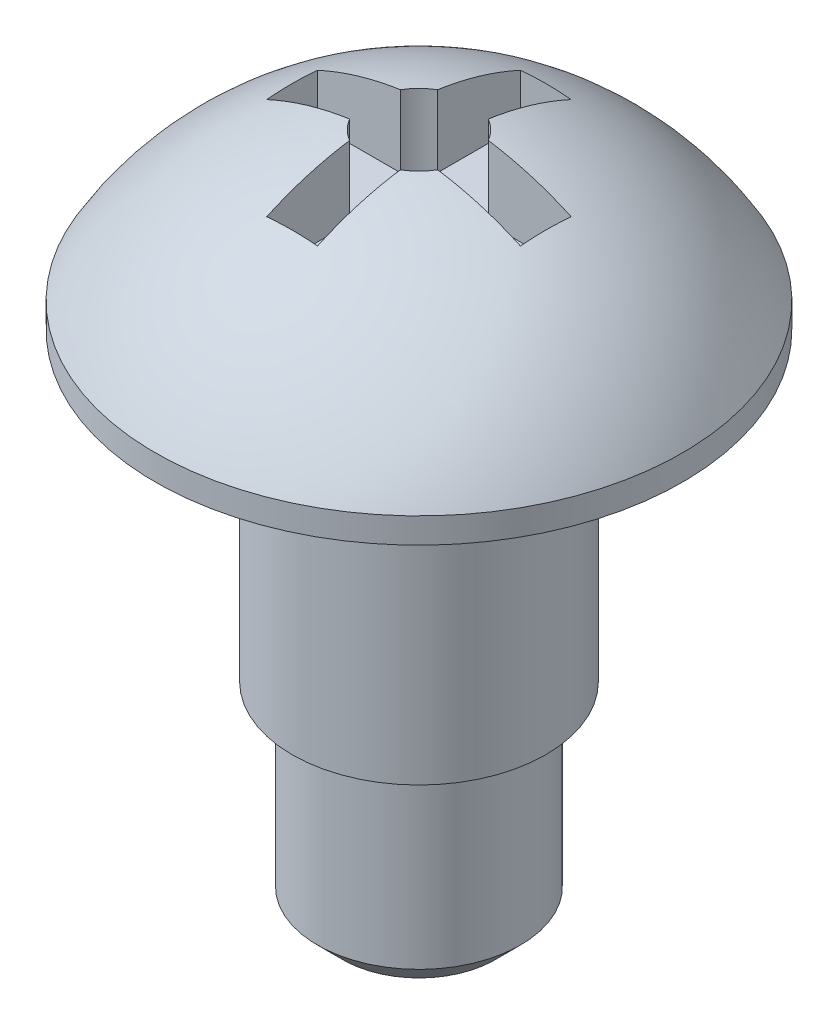
ISO-10303-21;
HEADER;
FILE_DESCRIPTION(('STEP AP214'),'2;1');
FILE_NAME('part.step','',(''),(''),'','','');
FILE_SCHEMA(('AUTOMOTIVE_DESIGN { 1 0 10303 214 1 1 1 1 }'));
ENDSEC;
DATA;
#1=APPLICATION_CONTEXT('core data for automotive mechanical design processes');
#2=APPLICATION_PROTOCOL_DEFINITION('international standard','automotive_design',2000,#1);
#3=PRODUCT_CONTEXT('',#1,'mechanical');
#4=PRODUCT('Part','Part','',(#3));
#5=PRODUCT_RELATED_PRODUCT_CATEGORY('part','',(#4));
#6=PRODUCT_DEFINITION_FORMATION('','',#4);
#7=PRODUCT_DEFINITION_CONTEXT('part definition',#1,'design');
#8=PRODUCT_DEFINITION('design','',#6,#7);
#9=PRODUCT_DEFINITION_SHAPE('','',#8);
#10=(LENGTH_UNIT() NAMED_UNIT(*) SI_UNIT(.MILLI.,.METRE.));
#11=(NAMED_UNIT(*) PLANE_ANGLE_UNIT() SI_UNIT($,.RADIAN.));
#12=(NAMED_UNIT(*) SI_UNIT($,.STERADIAN.) SOLID_ANGLE_UNIT());
#13=UNCERTAINTY_MEASURE_WITH_UNIT(LENGTH_MEASURE(1.E-05),#10,'distance_accuracy_value','');
#14=(GEOMETRIC_REPRESENTATION_CONTEXT(3) GLOBAL_UNCERTAINTY_ASSIGNED_CONTEXT((#13)) GLOBAL_UNIT_ASSIGNED_CONTEXT((#10,
#11,#12)) REPRESENTATION_CONTEXT('',''));
#15=CARTESIAN_POINT('',(0.,0.,0.));
#16=DIRECTION('',(0.,0.,1.));
#17=DIRECTION('',(1.,0.,0.));
#18=AXIS2_PLACEMENT_3D('',#15,#16,#17);
#19=CARTESIAN_POINT('',(0.,0.,0.));
#20=DIRECTION('',(0.,-1.,0.));
#21=DIRECTION('',(1.,0.,0.));
#22=AXIS2_PLACEMENT_3D('',#19,#20,#21);
#23=SPHERICAL_SURFACE('',#22,6.);
#24=CARTESIAN_POINT('',(0.,3.,0.));
#25=DIRECTION('',(0.,-1.,0.));
#26=DIRECTION('',(0.,0.,-1.));
#27=AXIS2_PLACEMENT_3D('',#24,#25,#26);
#28=CIRCLE('',#27,5.19615242270663);
#29=CARTESIAN_POINT('',(0.,3.,-5.19615242270663));
#30=VERTEX_POINT('',#29);
#31=EDGE_CURVE('E176',#30,#30,#28,.T.);
#32=ORIENTED_EDGE('',*,*,#31,.F.);
#33=EDGE_LOOP('',(#32));
#34=FACE_BOUND('',#33,.T.);
#35=CARTESIAN_POINT('',(-0.5,0.,0.));
#36=DIRECTION('',(1.,0.,0.));
#37=DIRECTION('',(0.,0.,-1.));
#38=AXIS2_PLACEMENT_3D('',#35,#36,#37);
#39=CIRCLE('',#38,5.9791303715507);
#40=CARTESIAN_POINT('',(-0.5,5.91607978309962,-0.866025403784439));
#41=VERTEX_POINT('',#40);
#42=CARTESIAN_POINT('',(-0.5,5.43139024560011,-2.5));
#43=VERTEX_POINT('',#42);
#44=EDGE_CURVE('E185',#41,#43,#39,.F.);
#45=ORIENTED_EDGE('',*,*,#44,.T.);
#46=CARTESIAN_POINT('',(0.,0.,-2.5));
#47=DIRECTION('',(0.,0.,1.));
#48=DIRECTION('',(1.,0.,0.));
#49=AXIS2_PLACEMENT_3D('',#46,#47,#48);
#50=CIRCLE('',#49,5.45435605731786);
#51=CARTESIAN_POINT('',(0.5,5.43139024560011,-2.5));
#52=VERTEX_POINT('',#51);
#53=EDGE_CURVE('E11',#43,#52,#50,.F.);
#54=ORIENTED_EDGE('',*,*,#53,.T.);
#55=CARTESIAN_POINT('',(0.5,0.,0.));
#56=DIRECTION('',(-1.,0.,0.));
#57=DIRECTION('',(0.,0.,1.));
#58=AXIS2_PLACEMENT_3D('',#55,#56,#57);
#59=CIRCLE('',#58,5.9791303715507);
#60=CARTESIAN_POINT('',(0.5,5.91607978309962,-0.866025403784439));
#61=VERTEX_POINT('',#60);
#62=EDGE_CURVE('E38',#52,#61,#59,.F.);
#63=ORIENTED_EDGE('',*,*,#62,.T.);
#64=CARTESIAN_POINT('',(0.,5.91607978309962,0.));
#65=DIRECTION('',(0.,-1.,0.));
#66=DIRECTION('',(0.,0.,-1.));
#67=AXIS2_PLACEMENT_3D('',#64,#65,#66);
#68=CIRCLE('',#67,1.);
#69=CARTESIAN_POINT('',(0.866025403784434,5.91607978309962,-0.500000000000009));
#70=VERTEX_POINT('',#69);
#71=EDGE_CURVE('E224',#61,#70,#68,.T.);
#72=ORIENTED_EDGE('',*,*,#71,.T.);
#73=CARTESIAN_POINT('',(0.,0.,-0.500000000000014));
#74=DIRECTION('',(0.,0.,1.));
#75=DIRECTION('',(1.,0.,0.));
#76=AXIS2_PLACEMENT_3D('',#73,#74,#75);
#77=CIRCLE('',#76,5.9791303715507);
#78=CARTESIAN_POINT('',(2.5,5.43139024560011,-0.499999999999999));
#79=VERTEX_POINT('',#78);
#80=EDGE_CURVE('E221',#70,#79,#77,.F.);
#81=ORIENTED_EDGE('',*,*,#80,.T.);
#82=CARTESIAN_POINT('',(2.5,0.,0.));
#83=DIRECTION('',(-1.,0.,0.));
#84=DIRECTION('',(0.,0.,1.));
#85=AXIS2_PLACEMENT_3D('',#82,#83,#84);
#86=CIRCLE('',#85,5.45435605731786);
#87=CARTESIAN_POINT('',(2.5,5.43139024560011,0.5));
#88=VERTEX_POINT('',#87);
#89=EDGE_CURVE('E218',#79,#88,#86,.F.);
#90=ORIENTED_EDGE('',*,*,#89,.T.);
#91=CARTESIAN_POINT('',(0.,0.,0.499999999999986));
#92=DIRECTION('',(0.,0.,-1.));
#93=DIRECTION('',(-1.,0.,0.));
#94=AXIS2_PLACEMENT_3D('',#91,#92,#93);
#95=CIRCLE('',#94,5.9791303715507);
#96=CARTESIAN_POINT('',(0.866025403784444,5.91607978309962,0.499999999999991));
#97=VERTEX_POINT('',#96);
#98=EDGE_CURVE('E215',#88,#97,#95,.F.);
#99=ORIENTED_EDGE('',*,*,#98,.T.);
#100=CARTESIAN_POINT('',(0.,5.91607978309962,0.));
#101=DIRECTION('',(0.,-1.,0.));
#102=DIRECTION('',(0.,0.,-1.));
#103=AXIS2_PLACEMENT_3D('',#100,#101,#102);
#104=CIRCLE('',#103,1.);
#105=CARTESIAN_POINT('',(0.500000000000006,5.91607978309962,0.866025403784435));
#106=VERTEX_POINT('',#105);
#107=EDGE_CURVE('E212',#97,#106,#104,.T.);
#108=ORIENTED_EDGE('',*,*,#107,.T.);
#109=CARTESIAN_POINT('',(0.500000000000009,0.,0.));
#110=DIRECTION('',(-1.,0.,0.));
#111=DIRECTION('',(0.,0.,1.));
#112=AXIS2_PLACEMENT_3D('',#109,#110,#111);
#113=CIRCLE('',#112,5.9791303715507);
#114=CARTESIAN_POINT('',(0.499999999999999,5.43139024560011,2.5));
#115=VERTEX_POINT('',#114);
#116=EDGE_CURVE('E209',#106,#115,#113,.F.);
#117=ORIENTED_EDGE('',*,*,#116,.T.);
#118=CARTESIAN_POINT('',(0.,0.,2.5));
#119=DIRECTION('',(0.,0.,-1.));
#120=DIRECTION('',(-1.,0.,0.));
#121=AXIS2_PLACEMENT_3D('',#118,#119,#120);
#122=CIRCLE('',#121,5.45435605731786);
#123=CARTESIAN_POINT('',(-0.5,5.43139024560011,2.5));
#124=VERTEX_POINT('',#123);
#125=EDGE_CURVE('E206',#115,#124,#122,.F.);
#126=ORIENTED_EDGE('',*,*,#125,.T.);
#127=CARTESIAN_POINT('',(-0.49999999999999,0.,0.));
#128=DIRECTION('',(1.,0.,0.));
#129=DIRECTION('',(0.,0.,-1.));
#130=AXIS2_PLACEMENT_3D('',#127,#128,#129);
#131=CIRCLE('',#130,5.9791303715507);
#132=CARTESIAN_POINT('',(-0.499999999999994,5.91607978309962,0.866025403784442));
#133=VERTEX_POINT('',#132);
#134=EDGE_CURVE('E203',#124,#133,#131,.F.);
#135=ORIENTED_EDGE('',*,*,#134,.T.);
#136=CARTESIAN_POINT('',(0.,5.91607978309962,0.));
#137=DIRECTION('',(0.,-1.,0.));
#138=DIRECTION('',(0.,0.,-1.));
#139=AXIS2_PLACEMENT_3D('',#136,#137,#138);
#140=CIRCLE('',#139,1.);
#141=CARTESIAN_POINT('',(-0.866025403784437,5.91607978309962,0.500000000000003));
#142=VERTEX_POINT('',#141);
#143=EDGE_CURVE('E200',#133,#142,#140,.T.);
#144=ORIENTED_EDGE('',*,*,#143,.T.);
#145=CARTESIAN_POINT('',(0.,0.,0.500000000000004));
#146=DIRECTION('',(0.,0.,-1.));
#147=DIRECTION('',(-1.,0.,0.));
#148=AXIS2_PLACEMENT_3D('',#145,#146,#147);
#149=CIRCLE('',#148,5.9791303715507);
#150=CARTESIAN_POINT('',(-2.5,5.43139024560011,0.499999999999999));
#151=VERTEX_POINT('',#150);
#152=EDGE_CURVE('E197',#142,#151,#149,.F.);
#153=ORIENTED_EDGE('',*,*,#152,.T.);
#154=CARTESIAN_POINT('',(-2.5,0.,0.));
#155=DIRECTION('',(1.,0.,0.));
#156=DIRECTION('',(0.,0.,-1.));
#157=AXIS2_PLACEMENT_3D('',#154,#155,#156);
#158=CIRCLE('',#157,5.45435605731786);
#159=CARTESIAN_POINT('',(-2.5,5.43139024560011,-0.5));
#160=VERTEX_POINT('',#159);
#161=EDGE_CURVE('E194',#151,#160,#158,.F.);
#162=ORIENTED_EDGE('',*,*,#161,.T.);
#163=CARTESIAN_POINT('',(0.,0.,-0.499999999999995));
#164=DIRECTION('',(0.,0.,1.));
#165=DIRECTION('',(1.,0.,0.));
#166=AXIS2_PLACEMENT_3D('',#163,#164,#165);
#167=CIRCLE('',#166,5.9791303715507);
#168=CARTESIAN_POINT('',(-0.86602540378444,5.91607978309962,-0.499999999999997));
#169=VERTEX_POINT('',#168);
#170=EDGE_CURVE('E191',#160,#169,#167,.F.);
#171=ORIENTED_EDGE('',*,*,#170,.T.);
#172=CARTESIAN_POINT('',(0.,5.91607978309962,0.));
#173=DIRECTION('',(0.,-1.,0.));
#174=DIRECTION('',(0.,0.,-1.));
#175=AXIS2_PLACEMENT_3D('',#172,#173,#174);
#176=CIRCLE('',#175,1.);
#177=EDGE_CURVE('E188',#169,#41,#176,.T.);
#178=ORIENTED_EDGE('',*,*,#177,.T.);
#179=EDGE_LOOP('',(#45,#54,#63,#72,#81,#90,#99,#108,#117,#126,#135,#144,#153,#162,#171,#178));
#180=FACE_BOUND('',#179,.T.);
#181=ADVANCED_FACE('F31',(#34,#180),#23,.T.);
#182=CARTESIAN_POINT('',(0.,-3.5,0.));
#183=DIRECTION('',(0.,-1.,0.));
#184=DIRECTION('',(0.,0.,-1.));
#185=AXIS2_PLACEMENT_3D('',#182,#183,#184);
#186=PLANE('',#185);
#187=CARTESIAN_POINT('',(0.,-3.5,0.));
#188=DIRECTION('',(0.,-1.,0.));
#189=DIRECTION('',(0.,0.,-1.));
#190=AXIS2_PLACEMENT_3D('',#187,#188,#189);
#191=CIRCLE('',#190,2.5);
#192=CARTESIAN_POINT('',(0.,-3.5,-2.5));
#193=VERTEX_POINT('',#192);
#194=EDGE_CURVE('E170',#193,#193,#191,.T.);
#195=ORIENTED_EDGE('',*,*,#194,.T.);
#196=EDGE_LOOP('',(#195));
#197=FACE_BOUND('',#196,.T.);
#198=CARTESIAN_POINT('',(0.,-3.5,0.));
#199=DIRECTION('',(0.,-1.,0.));
#200=DIRECTION('',(0.,0.,-1.));
#201=AXIS2_PLACEMENT_3D('',#198,#199,#200);
#202=CIRCLE('',#201,2.);
#203=CARTESIAN_POINT('',(0.,-3.5,-2.));
#204=VERTEX_POINT('',#203);
#205=EDGE_CURVE('E158',#204,#204,#202,.T.);
#206=ORIENTED_EDGE('',*,*,#205,.F.);
#207=EDGE_LOOP('',(#206));
#208=FACE_BOUND('',#207,.T.);
#209=ADVANCED_FACE('F352',(#197,#208),#186,.T.);
#210=CARTESIAN_POINT('',(0.,2.5,0.));
#211=DIRECTION('',(0.,-1.,0.));
#212=DIRECTION('',(0.,0.,-1.));
#213=AXIS2_PLACEMENT_3D('',#210,#211,#212);
#214=PLANE('',#213);
#215=CARTESIAN_POINT('',(0.,2.5,0.));
#216=DIRECTION('',(0.,-1.,0.));
#217=DIRECTION('',(0.,0.,-1.));
#218=AXIS2_PLACEMENT_3D('',#215,#216,#217);
#219=CIRCLE('',#218,5.19615242270663);
#220=CARTESIAN_POINT('',(0.,2.5,-5.19615242270663));
#221=VERTEX_POINT('',#220);
#222=EDGE_CURVE('E173',#221,#221,#219,.T.);
#223=ORIENTED_EDGE('',*,*,#222,.T.);
#224=EDGE_LOOP('',(#223));
#225=FACE_BOUND('',#224,.T.);
#226=CARTESIAN_POINT('',(0.,2.5,0.));
#227=DIRECTION('',(0.,-1.,0.));
#228=DIRECTION('',(0.,0.,-1.));
#229=AXIS2_PLACEMENT_3D('',#226,#227,#228);
#230=CIRCLE('',#229,2.5);
#231=CARTESIAN_POINT('',(0.,2.5,-2.5));
#232=VERTEX_POINT('',#231);
#233=EDGE_CURVE('E162',#232,#232,#230,.T.);
#234=ORIENTED_EDGE('',*,*,#233,.F.);
#235=EDGE_LOOP('',(#234));
#236=FACE_BOUND('',#235,.T.);
#237=ADVANCED_FACE('F357',(#225,#236),#214,.T.);
#238=CARTESIAN_POINT('',(0.,2.5,0.));
#239=DIRECTION('',(0.,1.,0.));
#240=DIRECTION('',(0.,0.,1.));
#241=AXIS2_PLACEMENT_3D('',#238,#239,#240);
#242=CYLINDRICAL_SURFACE('',#241,5.19615242270663);
#243=ORIENTED_EDGE('',*,*,#222,.F.);
#244=EDGE_LOOP('',(#243));
#245=FACE_BOUND('',#244,.T.);
#246=ORIENTED_EDGE('',*,*,#31,.T.);
#247=EDGE_LOOP('',(#246));
#248=FACE_BOUND('',#247,.T.);
#249=ADVANCED_FACE('F362',(#245,#248),#242,.T.);
#250=CARTESIAN_POINT('',(0.,-3.5,0.));
#251=DIRECTION('',(0.,1.,0.));
#252=DIRECTION('',(0.,0.,1.));
#253=AXIS2_PLACEMENT_3D('',#250,#251,#252);
#254=CYLINDRICAL_SURFACE('',#253,2.5);
#255=ORIENTED_EDGE('',*,*,#194,.F.);
#256=EDGE_LOOP('',(#255));
#257=FACE_BOUND('',#256,.T.);
#258=ORIENTED_EDGE('',*,*,#233,.T.);
#259=EDGE_LOOP('',(#258));
#260=FACE_BOUND('',#259,.T.);
#261=ADVANCED_FACE('F364',(#257,#260),#254,.T.);
#262=CARTESIAN_POINT('',(0.,-7.5,0.));
#263=DIRECTION('',(0.,1.,0.));
#264=DIRECTION('',(0.,0.,1.));
#265=AXIS2_PLACEMENT_3D('',#262,#263,#264);
#266=CYLINDRICAL_SURFACE('',#265,2.);
#267=CARTESIAN_POINT('',(0.,-7.,0.));
#268=DIRECTION('',(0.,-1.,0.));
#269=DIRECTION('',(0.,0.,-1.));
#270=AXIS2_PLACEMENT_3D('',#267,#268,#269);
#271=CIRCLE('',#270,2.);
#272=CARTESIAN_POINT('',(0.,-7.,-2.));
#273=VERTEX_POINT('',#272);
#274=EDGE_CURVE('E182',#273,#273,#271,.F.);
#275=ORIENTED_EDGE('',*,*,#274,.T.);
#276=EDGE_LOOP('',(#275));
#277=FACE_BOUND('',#276,.T.);
#278=ORIENTED_EDGE('',*,*,#205,.T.);
#279=EDGE_LOOP('',(#278));
#280=FACE_BOUND('',#279,.T.);
#281=ADVANCED_FACE('F370',(#277,#280),#266,.T.);
#282=CARTESIAN_POINT('',(0.,-7.5,0.));
#283=DIRECTION('',(0.,-1.,0.));
#284=DIRECTION('',(0.,0.,-1.));
#285=AXIS2_PLACEMENT_3D('',#282,#283,#284);
#286=PLANE('',#285);
#287=CARTESIAN_POINT('',(0.,-7.5,0.));
#288=DIRECTION('',(0.,-1.,0.));
#289=DIRECTION('',(0.,0.,-1.));
#290=AXIS2_PLACEMENT_3D('',#287,#288,#289);
#291=CIRCLE('',#290,1.49999999999999);
#292=CARTESIAN_POINT('',(0.,-7.5,-1.49999999999999));
#293=VERTEX_POINT('',#292);
#294=EDGE_CURVE('E179',#293,#293,#291,.T.);
#295=ORIENTED_EDGE('',*,*,#294,.T.);
#296=EDGE_LOOP('',(#295));
#297=FACE_BOUND('',#296,.T.);
#298=ADVANCED_FACE('F379',(#297),#286,.T.);
#299=CARTESIAN_POINT('',(0.,-7.5,0.));
#300=DIRECTION('',(0.,1.,0.));
#301=DIRECTION('',(0.,0.,1.));
#302=AXIS2_PLACEMENT_3D('',#299,#300,#301);
#303=CONICAL_SURFACE('',#302,1.49999999999999,0.785398163397453);
#304=ORIENTED_EDGE('',*,*,#274,.F.);
#305=EDGE_LOOP('',(#304));
#306=FACE_BOUND('',#305,.T.);
#307=ORIENTED_EDGE('',*,*,#294,.F.);
#308=EDGE_LOOP('',(#307));
#309=FACE_BOUND('',#308,.T.);
#310=ADVANCED_FACE('F383',(#306,#309),#303,.T.);
#311=CARTESIAN_POINT('',(0.5,4.5,-2.5));
#312=DIRECTION('',(0.,0.,1.));
#313=DIRECTION('',(1.,0.,0.));
#314=AXIS2_PLACEMENT_3D('',#311,#312,#313);
#315=PLANE('',#314);
#316=DIRECTION('',(0.,1.,0.));
#317=VECTOR('',#316,1.);
#318=CARTESIAN_POINT('',(-0.5,4.5,-2.5));
#319=LINE('',#318,#317);
#320=CARTESIAN_POINT('',(-0.5,4.5,-2.5));
#321=VERTEX_POINT('',#320);
#322=EDGE_CURVE('E45',#321,#43,#319,.T.);
#323=ORIENTED_EDGE('',*,*,#322,.F.);
#324=DIRECTION('',(1.,0.,0.));
#325=VECTOR('',#324,1.);
#326=CARTESIAN_POINT('',(0.5,4.5,-2.5));
#327=LINE('',#326,#325);
#328=CARTESIAN_POINT('',(0.5,4.5,-2.5));
#329=VERTEX_POINT('',#328);
#330=EDGE_CURVE('E148',#321,#329,#327,.T.);
#331=ORIENTED_EDGE('',*,*,#330,.T.);
#332=DIRECTION('',(0.,1.,0.));
#333=VECTOR('',#332,1.);
#334=CARTESIAN_POINT('',(0.5,4.5,-2.5));
#335=LINE('',#334,#333);
#336=EDGE_CURVE('E155',#329,#52,#335,.T.);
#337=ORIENTED_EDGE('',*,*,#336,.T.);
#338=ORIENTED_EDGE('',*,*,#53,.F.);
#339=EDGE_LOOP('',(#323,#331,#337,#338));
#340=FACE_BOUND('',#339,.T.);
#341=ADVANCED_FACE('F154',(#340),#315,.T.);
#342=CARTESIAN_POINT('',(0.5,4.5,-2.5));
#343=DIRECTION('',(-1.,0.,0.));
#344=DIRECTION('',(0.,0.,1.));
#345=AXIS2_PLACEMENT_3D('',#342,#343,#344);
#346=PLANE('',#345);
#347=ORIENTED_EDGE('',*,*,#336,.F.);
#348=DIRECTION('',(0.,0.,1.));
#349=VECTOR('',#348,1.);
#350=CARTESIAN_POINT('',(0.5,4.5,-2.5));
#351=LINE('',#350,#349);
#352=CARTESIAN_POINT('',(0.5,4.5,-0.866025403784439));
#353=VERTEX_POINT('',#352);
#354=EDGE_CURVE('E144',#329,#353,#351,.T.);
#355=ORIENTED_EDGE('',*,*,#354,.T.);
#356=DIRECTION('',(0.,1.,0.));
#357=VECTOR('',#356,1.);
#358=CARTESIAN_POINT('',(0.5,4.5,-0.866025403784439));
#359=LINE('',#358,#357);
#360=EDGE_CURVE('E159',#353,#61,#359,.T.);
#361=ORIENTED_EDGE('',*,*,#360,.T.);
#362=ORIENTED_EDGE('',*,*,#62,.F.);
#363=EDGE_LOOP('',(#347,#355,#361,#362));
#364=FACE_BOUND('',#363,.T.);
#365=ADVANCED_FACE('F157',(#364),#346,.T.);
#366=CARTESIAN_POINT('',(0.,4.5,0.));
#367=DIRECTION('',(0.,1.,0.));
#368=DIRECTION('',(0.,0.,1.));
#369=AXIS2_PLACEMENT_3D('',#366,#367,#368);
#370=CYLINDRICAL_SURFACE('',#369,1.);
#371=ORIENTED_EDGE('',*,*,#360,.F.);
#372=CARTESIAN_POINT('',(0.,4.5,0.));
#373=DIRECTION('',(0.,-1.,0.));
#374=DIRECTION('',(0.,0.,-1.));
#375=AXIS2_PLACEMENT_3D('',#372,#373,#374);
#376=CIRCLE('',#375,1.);
#377=CARTESIAN_POINT('',(0.866025403784434,4.5,-0.500000000000009));
#378=VERTEX_POINT('',#377);
#379=EDGE_CURVE('E150',#353,#378,#376,.T.);
#380=ORIENTED_EDGE('',*,*,#379,.T.);
#381=DIRECTION('',(0.,1.,0.));
#382=VECTOR('',#381,1.);
#383=CARTESIAN_POINT('',(0.866025403784434,4.5,-0.500000000000009));
#384=LINE('',#383,#382);
#385=EDGE_CURVE('E164',#378,#70,#384,.T.);
#386=ORIENTED_EDGE('',*,*,#385,.T.);
#387=ORIENTED_EDGE('',*,*,#71,.F.);
#388=EDGE_LOOP('',(#371,#380,#386,#387));
#389=FACE_BOUND('',#388,.T.);
#390=ADVANCED_FACE('F276',(#389),#370,.F.);
#391=CARTESIAN_POINT('',(2.5,4.5,-0.499999999999999));
#392=DIRECTION('',(0.,0.,1.));
#393=DIRECTION('',(1.,0.,0.));
#394=AXIS2_PLACEMENT_3D('',#391,#392,#393);
#395=PLANE('',#394);
#396=ORIENTED_EDGE('',*,*,#385,.F.);
#397=DIRECTION('',(1.,0.,0.));
#398=VECTOR('',#397,1.);
#399=CARTESIAN_POINT('',(2.5,4.5,-0.499999999999999));
#400=LINE('',#399,#398);
#401=CARTESIAN_POINT('',(2.5,4.5,-0.499999999999999));
#402=VERTEX_POINT('',#401);
#403=EDGE_CURVE('E279',#378,#402,#400,.T.);
#404=ORIENTED_EDGE('',*,*,#403,.T.);
#405=DIRECTION('',(0.,1.,0.));
#406=VECTOR('',#405,1.);
#407=CARTESIAN_POINT('',(2.5,4.5,-0.499999999999999));
#408=LINE('',#407,#406);
#409=EDGE_CURVE('E271',#402,#79,#408,.T.);
#410=ORIENTED_EDGE('',*,*,#409,.T.);
#411=ORIENTED_EDGE('',*,*,#80,.F.);
#412=EDGE_LOOP('',(#396,#404,#410,#411));
#413=FACE_BOUND('',#412,.T.);
#414=ADVANCED_FACE('F278',(#413),#395,.T.);
#415=CARTESIAN_POINT('',(2.5,4.5,0.5));
#416=DIRECTION('',(-1.,0.,0.));
#417=DIRECTION('',(0.,0.,1.));
#418=AXIS2_PLACEMENT_3D('',#415,#416,#417);
#419=PLANE('',#418);
#420=ORIENTED_EDGE('',*,*,#409,.F.);
#421=DIRECTION('',(0.,0.,1.));
#422=VECTOR('',#421,1.);
#423=CARTESIAN_POINT('',(2.5,4.5,0.5));
#424=LINE('',#423,#422);
#425=CARTESIAN_POINT('',(2.5,4.5,0.5));
#426=VERTEX_POINT('',#425);
#427=EDGE_CURVE('E283',#402,#426,#424,.T.);
#428=ORIENTED_EDGE('',*,*,#427,.T.);
#429=DIRECTION('',(0.,1.,0.));
#430=VECTOR('',#429,1.);
#431=CARTESIAN_POINT('',(2.5,4.5,0.5));
#432=LINE('',#431,#430);
#433=EDGE_CURVE('E268',#426,#88,#432,.T.);
#434=ORIENTED_EDGE('',*,*,#433,.T.);
#435=ORIENTED_EDGE('',*,*,#89,.F.);
#436=EDGE_LOOP('',(#420,#428,#434,#435));
#437=FACE_BOUND('',#436,.T.);
#438=ADVANCED_FACE('F342',(#437),#419,.T.);
#439=CARTESIAN_POINT('',(2.5,4.5,0.5));
#440=DIRECTION('',(0.,0.,-1.));
#441=DIRECTION('',(-1.,0.,0.));
#442=AXIS2_PLACEMENT_3D('',#439,#440,#441);
#443=PLANE('',#442);
#444=ORIENTED_EDGE('',*,*,#433,.F.);
#445=DIRECTION('',(-1.,0.,0.));
#446=VECTOR('',#445,1.);
#447=CARTESIAN_POINT('',(2.5,4.5,0.5));
#448=LINE('',#447,#446);
#449=CARTESIAN_POINT('',(0.866025403784444,4.5,0.499999999999991));
#450=VERTEX_POINT('',#449);
#451=EDGE_CURVE('E285',#426,#450,#448,.T.);
#452=ORIENTED_EDGE('',*,*,#451,.T.);
#453=DIRECTION('',(0.,1.,0.));
#454=VECTOR('',#453,1.);
#455=CARTESIAN_POINT('',(0.866025403784444,4.5,0.499999999999991));
#456=LINE('',#455,#454);
#457=EDGE_CURVE('E265',#450,#97,#456,.T.);
#458=ORIENTED_EDGE('',*,*,#457,.T.);
#459=ORIENTED_EDGE('',*,*,#98,.F.);
#460=EDGE_LOOP('',(#444,#452,#458,#459));
#461=FACE_BOUND('',#460,.T.);
#462=ADVANCED_FACE('F340',(#461),#443,.T.);
#463=CARTESIAN_POINT('',(0.,4.5,0.));
#464=DIRECTION('',(0.,1.,0.));
#465=DIRECTION('',(0.,0.,1.));
#466=AXIS2_PLACEMENT_3D('',#463,#464,#465);
#467=CYLINDRICAL_SURFACE('',#466,1.);
#468=ORIENTED_EDGE('',*,*,#457,.F.);
#469=CARTESIAN_POINT('',(0.,4.5,0.));
#470=DIRECTION('',(0.,-1.,0.));
#471=DIRECTION('',(0.,0.,-1.));
#472=AXIS2_PLACEMENT_3D('',#469,#470,#471);
#473=CIRCLE('',#472,1.);
#474=CARTESIAN_POINT('',(0.500000000000006,4.5,0.866025403784435));
#475=VERTEX_POINT('',#474);
#476=EDGE_CURVE('E290',#450,#475,#473,.T.);
#477=ORIENTED_EDGE('',*,*,#476,.T.);
#478=DIRECTION('',(0.,1.,0.));
#479=VECTOR('',#478,1.);
#480=CARTESIAN_POINT('',(0.500000000000006,4.5,0.866025403784435));
#481=LINE('',#480,#479);
#482=EDGE_CURVE('E262',#475,#106,#481,.T.);
#483=ORIENTED_EDGE('',*,*,#482,.T.);
#484=ORIENTED_EDGE('',*,*,#107,.F.);
#485=EDGE_LOOP('',(#468,#477,#483,#484));
#486=FACE_BOUND('',#485,.T.);
#487=ADVANCED_FACE('F336',(#486),#467,.F.);
#488=CARTESIAN_POINT('',(0.499999999999999,4.5,2.5));
#489=DIRECTION('',(-1.,0.,0.));
#490=DIRECTION('',(0.,0.,1.));
#491=AXIS2_PLACEMENT_3D('',#488,#489,#490);
#492=PLANE('',#491);
#493=ORIENTED_EDGE('',*,*,#482,.F.);
#494=DIRECTION('',(0.,0.,1.));
#495=VECTOR('',#494,1.);
#496=CARTESIAN_POINT('',(0.499999999999999,4.5,2.5));
#497=LINE('',#496,#495);
#498=CARTESIAN_POINT('',(0.499999999999999,4.5,2.5));
#499=VERTEX_POINT('',#498);
#500=EDGE_CURVE('E292',#475,#499,#497,.T.);
#501=ORIENTED_EDGE('',*,*,#500,.T.);
#502=DIRECTION('',(0.,1.,0.));
#503=VECTOR('',#502,1.);
#504=CARTESIAN_POINT('',(0.499999999999999,4.5,2.5));
#505=LINE('',#504,#503);
#506=EDGE_CURVE('E259',#499,#115,#505,.T.);
#507=ORIENTED_EDGE('',*,*,#506,.T.);
#508=ORIENTED_EDGE('',*,*,#116,.F.);
#509=EDGE_LOOP('',(#493,#501,#507,#508));
#510=FACE_BOUND('',#509,.T.);
#511=ADVANCED_FACE('F333',(#510),#492,.T.);
#512=CARTESIAN_POINT('',(-0.5,4.5,2.5));
#513=DIRECTION('',(0.,0.,-1.));
#514=DIRECTION('',(-1.,0.,0.));
#515=AXIS2_PLACEMENT_3D('',#512,#513,#514);
#516=PLANE('',#515);
#517=ORIENTED_EDGE('',*,*,#506,.F.);
#518=DIRECTION('',(-1.,0.,0.));
#519=VECTOR('',#518,1.);
#520=CARTESIAN_POINT('',(-0.5,4.5,2.5));
#521=LINE('',#520,#519);
#522=CARTESIAN_POINT('',(-0.5,4.5,2.5));
#523=VERTEX_POINT('',#522);
#524=EDGE_CURVE('E294',#499,#523,#521,.T.);
#525=ORIENTED_EDGE('',*,*,#524,.T.);
#526=DIRECTION('',(0.,1.,0.));
#527=VECTOR('',#526,1.);
#528=CARTESIAN_POINT('',(-0.5,4.5,2.5));
#529=LINE('',#528,#527);
#530=EDGE_CURVE('E256',#523,#124,#529,.T.);
#531=ORIENTED_EDGE('',*,*,#530,.T.);
#532=ORIENTED_EDGE('',*,*,#125,.F.);
#533=EDGE_LOOP('',(#517,#525,#531,#532));
#534=FACE_BOUND('',#533,.T.);
#535=ADVANCED_FACE('F330',(#534),#516,.T.);
#536=CARTESIAN_POINT('',(-0.5,4.5,2.5));
#537=DIRECTION('',(1.,0.,0.));
#538=DIRECTION('',(0.,0.,-1.));
#539=AXIS2_PLACEMENT_3D('',#536,#537,#538);
#540=PLANE('',#539);
#541=ORIENTED_EDGE('',*,*,#530,.F.);
#542=DIRECTION('',(0.,0.,-1.));
#543=VECTOR('',#542,1.);
#544=CARTESIAN_POINT('',(-0.5,4.5,2.5));
#545=LINE('',#544,#543);
#546=CARTESIAN_POINT('',(-0.499999999999994,4.5,0.866025403784442));
#547=VERTEX_POINT('',#546);
#548=EDGE_CURVE('E296',#523,#547,#545,.T.);
#549=ORIENTED_EDGE('',*,*,#548,.T.);
#550=DIRECTION('',(0.,1.,0.));
#551=VECTOR('',#550,1.);
#552=CARTESIAN_POINT('',(-0.499999999999994,4.5,0.866025403784442));
#553=LINE('',#552,#551);
#554=EDGE_CURVE('E253',#547,#133,#553,.T.);
#555=ORIENTED_EDGE('',*,*,#554,.T.);
#556=ORIENTED_EDGE('',*,*,#134,.F.);
#557=EDGE_LOOP('',(#541,#549,#555,#556));
#558=FACE_BOUND('',#557,.T.);
#559=ADVANCED_FACE('F327',(#558),#540,.T.);
#560=CARTESIAN_POINT('',(0.,4.5,0.));
#561=DIRECTION('',(0.,1.,0.));
#562=DIRECTION('',(0.,0.,1.));
#563=AXIS2_PLACEMENT_3D('',#560,#561,#562);
#564=CYLINDRICAL_SURFACE('',#563,1.);
#565=ORIENTED_EDGE('',*,*,#554,.F.);
#566=CARTESIAN_POINT('',(0.,4.5,0.));
#567=DIRECTION('',(0.,-1.,0.));
#568=DIRECTION('',(0.,0.,-1.));
#569=AXIS2_PLACEMENT_3D('',#566,#567,#568);
#570=CIRCLE('',#569,1.);
#571=CARTESIAN_POINT('',(-0.866025403784437,4.5,0.500000000000003));
#572=VERTEX_POINT('',#571);
#573=EDGE_CURVE('E298',#547,#572,#570,.T.);
#574=ORIENTED_EDGE('',*,*,#573,.T.);
#575=DIRECTION('',(0.,1.,0.));
#576=VECTOR('',#575,1.);
#577=CARTESIAN_POINT('',(-0.866025403784437,4.5,0.500000000000003));
#578=LINE('',#577,#576);
#579=EDGE_CURVE('E250',#572,#142,#578,.T.);
#580=ORIENTED_EDGE('',*,*,#579,.T.);
#581=ORIENTED_EDGE('',*,*,#143,.F.);
#582=EDGE_LOOP('',(#565,#574,#580,#581));
#583=FACE_BOUND('',#582,.T.);
#584=ADVANCED_FACE('F320',(#583),#564,.F.);
#585=CARTESIAN_POINT('',(-2.5,4.5,0.499999999999999));
#586=DIRECTION('',(0.,0.,-1.));
#587=DIRECTION('',(-1.,0.,0.));
#588=AXIS2_PLACEMENT_3D('',#585,#586,#587);
#589=PLANE('',#588);
#590=ORIENTED_EDGE('',*,*,#579,.F.);
#591=DIRECTION('',(-1.,0.,0.));
#592=VECTOR('',#591,1.);
#593=CARTESIAN_POINT('',(-2.5,4.5,0.499999999999999));
#594=LINE('',#593,#592);
#595=CARTESIAN_POINT('',(-2.5,4.5,0.499999999999999));
#596=VERTEX_POINT('',#595);
#597=EDGE_CURVE('E300',#572,#596,#594,.T.);
#598=ORIENTED_EDGE('',*,*,#597,.T.);
#599=DIRECTION('',(0.,1.,0.));
#600=VECTOR('',#599,1.);
#601=CARTESIAN_POINT('',(-2.5,4.5,0.499999999999999));
#602=LINE('',#601,#600);
#603=EDGE_CURVE('E247',#596,#151,#602,.T.);
#604=ORIENTED_EDGE('',*,*,#603,.T.);
#605=ORIENTED_EDGE('',*,*,#152,.F.);
#606=EDGE_LOOP('',(#590,#598,#604,#605));
#607=FACE_BOUND('',#606,.T.);
#608=ADVANCED_FACE('F317',(#607),#589,.T.);
#609=CARTESIAN_POINT('',(-2.5,4.5,-0.5));
#610=DIRECTION('',(1.,0.,0.));
#611=DIRECTION('',(0.,0.,-1.));
#612=AXIS2_PLACEMENT_3D('',#609,#610,#611);
#613=PLANE('',#612);
#614=ORIENTED_EDGE('',*,*,#603,.F.);
#615=DIRECTION('',(0.,0.,-1.));
#616=VECTOR('',#615,1.);
#617=CARTESIAN_POINT('',(-2.5,4.5,-0.5));
#618=LINE('',#617,#616);
#619=CARTESIAN_POINT('',(-2.5,4.5,-0.5));
#620=VERTEX_POINT('',#619);
#621=EDGE_CURVE('E302',#596,#620,#618,.T.);
#622=ORIENTED_EDGE('',*,*,#621,.T.);
#623=DIRECTION('',(0.,1.,0.));
#624=VECTOR('',#623,1.);
#625=CARTESIAN_POINT('',(-2.5,4.5,-0.5));
#626=LINE('',#625,#624);
#627=EDGE_CURVE('E239',#620,#160,#626,.T.);
#628=ORIENTED_EDGE('',*,*,#627,.T.);
#629=ORIENTED_EDGE('',*,*,#161,.F.);
#630=EDGE_LOOP('',(#614,#622,#628,#629));
#631=FACE_BOUND('',#630,.T.);
#632=ADVANCED_FACE('F314',(#631),#613,.T.);
#633=CARTESIAN_POINT('',(-2.5,4.5,-0.5));
#634=DIRECTION('',(0.,0.,1.));
#635=DIRECTION('',(1.,0.,0.));
#636=AXIS2_PLACEMENT_3D('',#633,#634,#635);
#637=PLANE('',#636);
#638=ORIENTED_EDGE('',*,*,#627,.F.);
#639=DIRECTION('',(1.,0.,0.));
#640=VECTOR('',#639,1.);
#641=CARTESIAN_POINT('',(-2.5,4.5,-0.5));
#642=LINE('',#641,#640);
#643=CARTESIAN_POINT('',(-0.86602540378444,4.5,-0.499999999999997));
#644=VERTEX_POINT('',#643);
#645=EDGE_CURVE('E304',#620,#644,#642,.T.);
#646=ORIENTED_EDGE('',*,*,#645,.T.);
#647=DIRECTION('',(0.,1.,0.));
#648=VECTOR('',#647,1.);
#649=CARTESIAN_POINT('',(-0.86602540378444,4.5,-0.499999999999997));
#650=LINE('',#649,#648);
#651=EDGE_CURVE('E237',#644,#169,#650,.T.);
#652=ORIENTED_EDGE('',*,*,#651,.T.);
#653=ORIENTED_EDGE('',*,*,#170,.F.);
#654=EDGE_LOOP('',(#638,#646,#652,#653));
#655=FACE_BOUND('',#654,.T.);
#656=ADVANCED_FACE('F311',(#655),#637,.T.);
#657=CARTESIAN_POINT('',(0.,4.5,0.));
#658=DIRECTION('',(0.,1.,0.));
#659=DIRECTION('',(0.,0.,1.));
#660=AXIS2_PLACEMENT_3D('',#657,#658,#659);
#661=CYLINDRICAL_SURFACE('',#660,1.);
#662=ORIENTED_EDGE('',*,*,#651,.F.);
#663=CARTESIAN_POINT('',(0.,4.5,0.));
#664=DIRECTION('',(0.,-1.,0.));
#665=DIRECTION('',(0.,0.,-1.));
#666=AXIS2_PLACEMENT_3D('',#663,#664,#665);
#667=CIRCLE('',#666,1.);
#668=CARTESIAN_POINT('',(-0.5,4.5,-0.866025403784439));
#669=VERTEX_POINT('',#668);
#670=EDGE_CURVE('E236',#644,#669,#667,.T.);
#671=ORIENTED_EDGE('',*,*,#670,.T.);
#672=DIRECTION('',(0.,1.,0.));
#673=VECTOR('',#672,1.);
#674=CARTESIAN_POINT('',(-0.5,4.5,-0.866025403784439));
#675=LINE('',#674,#673);
#676=EDGE_CURVE('E230',#669,#41,#675,.T.);
#677=ORIENTED_EDGE('',*,*,#676,.T.);
#678=ORIENTED_EDGE('',*,*,#177,.F.);
#679=EDGE_LOOP('',(#662,#671,#677,#678));
#680=FACE_BOUND('',#679,.T.);
#681=ADVANCED_FACE('F233',(#680),#661,.F.);
#682=CARTESIAN_POINT('',(-0.5,4.5,-2.5));
#683=DIRECTION('',(1.,0.,0.));
#684=DIRECTION('',(0.,0.,-1.));
#685=AXIS2_PLACEMENT_3D('',#682,#683,#684);
#686=PLANE('',#685);
#687=ORIENTED_EDGE('',*,*,#676,.F.);
#688=DIRECTION('',(0.,0.,-1.));
#689=VECTOR('',#688,1.);
#690=CARTESIAN_POINT('',(-0.5,4.5,-2.5));
#691=LINE('',#690,#689);
#692=EDGE_CURVE('E241',#669,#321,#691,.T.);
#693=ORIENTED_EDGE('',*,*,#692,.T.);
#694=ORIENTED_EDGE('',*,*,#322,.T.);
#695=ORIENTED_EDGE('',*,*,#44,.F.);
#696=EDGE_LOOP('',(#687,#693,#694,#695));
#697=FACE_BOUND('',#696,.T.);
#698=ADVANCED_FACE('F229',(#697),#686,.T.);
#699=CARTESIAN_POINT('',(0.,4.5,0.));
#700=DIRECTION('',(0.,-1.,0.));
#701=DIRECTION('',(0.,0.,-1.));
#702=AXIS2_PLACEMENT_3D('',#699,#700,#701);
#703=PLANE('',#702);
#704=ORIENTED_EDGE('',*,*,#330,.F.);
#705=ORIENTED_EDGE('',*,*,#692,.F.);
#706=ORIENTED_EDGE('',*,*,#670,.F.);
#707=ORIENTED_EDGE('',*,*,#645,.F.);
#708=ORIENTED_EDGE('',*,*,#621,.F.);
#709=ORIENTED_EDGE('',*,*,#597,.F.);
#710=ORIENTED_EDGE('',*,*,#573,.F.);
#711=ORIENTED_EDGE('',*,*,#548,.F.);
#712=ORIENTED_EDGE('',*,*,#524,.F.);
#713=ORIENTED_EDGE('',*,*,#500,.F.);
#714=ORIENTED_EDGE('',*,*,#476,.F.);
#715=ORIENTED_EDGE('',*,*,#451,.F.);
#716=ORIENTED_EDGE('',*,*,#427,.F.);
#717=ORIENTED_EDGE('',*,*,#403,.F.);
#718=ORIENTED_EDGE('',*,*,#379,.F.);
#719=ORIENTED_EDGE('',*,*,#354,.F.);
#720=EDGE_LOOP('',(#704,#705,#706,#707,#708,#709,#710,#711,#712,#713,#714,#715,#716,#717,#718,#719));
#721=FACE_BOUND('',#720,.T.);
#722=ADVANCED_FACE('F146',(#721),#703,.F.);
#723=CLOSED_SHELL('',(#181,#209,#237,#249,#261,#281,#298,#310,#341,#365,#390,#414,#438,#462,
#487,#511,#535,#559,#584,#608,#632,#656,#681,#698,#722));
#724=MANIFOLD_SOLID_BREP('B2',#723);
#725=ADVANCED_BREP_SHAPE_REPRESENTATION('',(#18,#724),#14);
#726=SHAPE_DEFINITION_REPRESENTATION(#9,#725);
ENDSEC;
END-ISO-10303-21;
